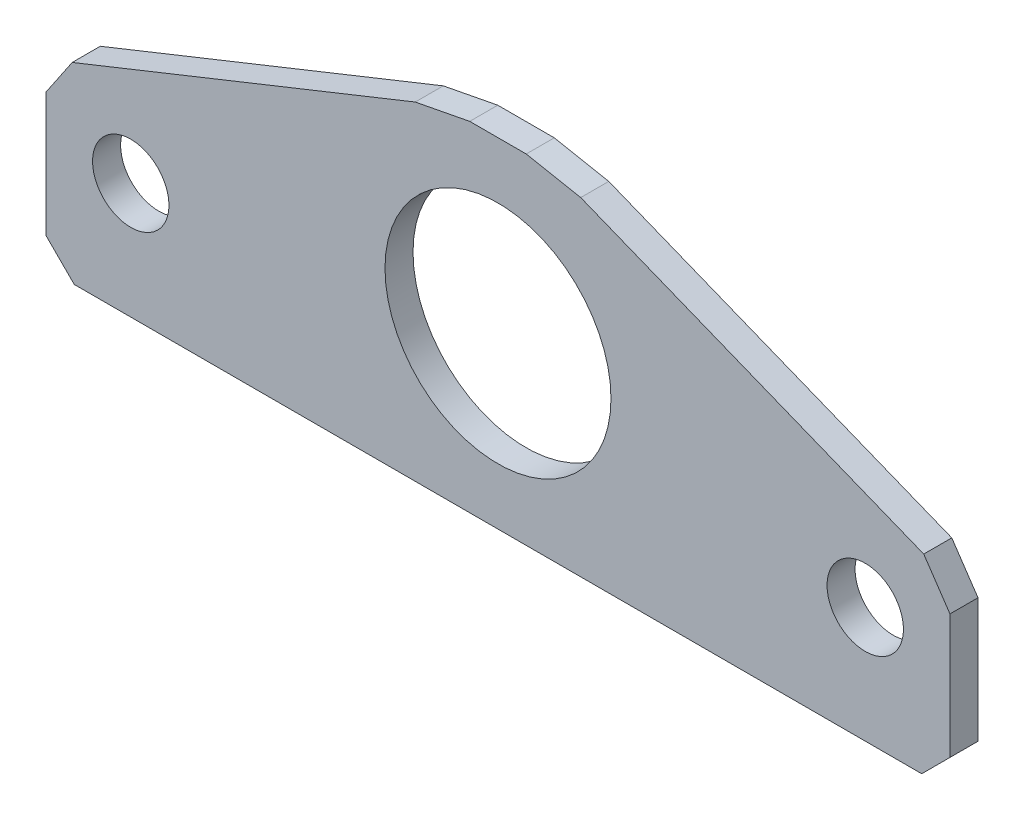
ISO-10303-21;
HEADER;
FILE_DESCRIPTION(('STEP AP214'),'2;1');
FILE_NAME('part.step','',(''),(''),'','','');
FILE_SCHEMA(('AUTOMOTIVE_DESIGN { 1 0 10303 214 1 1 1 1 }'));
ENDSEC;
DATA;
#1=APPLICATION_CONTEXT('core data for automotive mechanical design processes');
#2=APPLICATION_PROTOCOL_DEFINITION('international standard','automotive_design',2000,#1);
#3=PRODUCT_CONTEXT('',#1,'mechanical');
#4=PRODUCT('Part','Part','',(#3));
#5=PRODUCT_RELATED_PRODUCT_CATEGORY('part','',(#4));
#6=PRODUCT_DEFINITION_FORMATION('','',#4);
#7=PRODUCT_DEFINITION_CONTEXT('part definition',#1,'design');
#8=PRODUCT_DEFINITION('design','',#6,#7);
#9=PRODUCT_DEFINITION_SHAPE('','',#8);
#10=(LENGTH_UNIT() NAMED_UNIT(*) SI_UNIT(.MILLI.,.METRE.));
#11=(NAMED_UNIT(*) PLANE_ANGLE_UNIT() SI_UNIT($,.RADIAN.));
#12=(NAMED_UNIT(*) SI_UNIT($,.STERADIAN.) SOLID_ANGLE_UNIT());
#13=UNCERTAINTY_MEASURE_WITH_UNIT(LENGTH_MEASURE(1.E-05),#10,'distance_accuracy_value','');
#14=(GEOMETRIC_REPRESENTATION_CONTEXT(3) GLOBAL_UNCERTAINTY_ASSIGNED_CONTEXT((#13)) GLOBAL_UNIT_ASSIGNED_CONTEXT((#10,
#11,#12)) REPRESENTATION_CONTEXT('',''));
#15=CARTESIAN_POINT('',(0.,0.,0.));
#16=DIRECTION('',(0.,0.,1.));
#17=DIRECTION('',(1.,0.,0.));
#18=AXIS2_PLACEMENT_3D('',#15,#16,#17);
#19=CARTESIAN_POINT('',(25.4,20.955,1.5748));
#20=DIRECTION('',(0.,0.,-1.));
#21=DIRECTION('',(-1.,0.,0.));
#22=AXIS2_PLACEMENT_3D('',#19,#20,#21);
#23=PLANE('',#22);
#24=CARTESIAN_POINT('',(0.,0.,1.5748));
#25=DIRECTION('',(0.,0.,-1.));
#26=DIRECTION('',(-1.,0.,0.));
#27=AXIS2_PLACEMENT_3D('',#24,#25,#26);
#28=CIRCLE('',#27,6.35);
#29=CARTESIAN_POINT('',(-6.35,0.,1.5748));
#30=VERTEX_POINT('',#29);
#31=EDGE_CURVE('E135',#30,#30,#28,.T.);
#32=ORIENTED_EDGE('',*,*,#31,.T.);
#33=EDGE_LOOP('',(#32));
#34=FACE_BOUND('',#33,.T.);
#35=CARTESIAN_POINT('',(20.6375,-3.01285021,1.5748));
#36=DIRECTION('',(0.,0.,-1.));
#37=DIRECTION('',(-1.,0.,0.));
#38=AXIS2_PLACEMENT_3D('',#35,#36,#37);
#39=CIRCLE('',#38,2.1463);
#40=CARTESIAN_POINT('',(18.4912,-3.01285021,1.5748));
#41=VERTEX_POINT('',#40);
#42=EDGE_CURVE('E138',#41,#41,#39,.T.);
#43=ORIENTED_EDGE('',*,*,#42,.T.);
#44=EDGE_LOOP('',(#43));
#45=FACE_BOUND('',#44,.T.);
#46=CARTESIAN_POINT('',(-20.6375,-3.01285021,1.5748));
#47=DIRECTION('',(0.,0.,-1.));
#48=DIRECTION('',(-1.,0.,0.));
#49=AXIS2_PLACEMENT_3D('',#46,#47,#48);
#50=CIRCLE('',#49,2.1463);
#51=CARTESIAN_POINT('',(-22.7838,-3.01285021,1.5748));
#52=VERTEX_POINT('',#51);
#53=EDGE_CURVE('E20',#52,#52,#50,.T.);
#54=ORIENTED_EDGE('',*,*,#53,.T.);
#55=EDGE_LOOP('',(#54));
#56=FACE_BOUND('',#55,.T.);
#57=DIRECTION('',(0.560628809305184,0.828067230469272,0.));
#58=VECTOR('',#57,1.);
#59=CARTESIAN_POINT('',(-25.4,-0.9525,1.5748));
#60=LINE('',#59,#58);
#61=CARTESIAN_POINT('',(-23.9260432538003,1.22458269817676,1.5748));
#62=VERTEX_POINT('',#61);
#63=CARTESIAN_POINT('',(-25.4000000003079,-0.952500000699517,1.5748));
#64=VERTEX_POINT('',#63);
#65=EDGE_CURVE('E118',#62,#64,#60,.F.);
#66=ORIENTED_EDGE('',*,*,#65,.T.);
#67=DIRECTION('',(0.,1.,0.));
#68=VECTOR('',#67,1.);
#69=CARTESIAN_POINT('',(-25.4,0.635,1.5748));
#70=LINE('',#69,#68);
#71=CARTESIAN_POINT('',(-25.4000000002538,-7.93749999997375,1.5748));
#72=VERTEX_POINT('',#71);
#73=EDGE_CURVE('E108',#64,#72,#70,.F.);
#74=ORIENTED_EDGE('',*,*,#73,.T.);
#75=DIRECTION('',(-0.707106781186548,0.707106781186548,0.));
#76=VECTOR('',#75,1.);
#77=CARTESIAN_POINT('',(-23.8125,-9.525,1.5748));
#78=LINE('',#77,#76);
#79=CARTESIAN_POINT('',(-23.8125000002938,-9.52500000011875,1.5748));
#80=VERTEX_POINT('',#79);
#81=EDGE_CURVE('E143',#72,#80,#78,.F.);
#82=ORIENTED_EDGE('',*,*,#81,.T.);
#83=DIRECTION('',(-1.,0.,0.));
#84=VECTOR('',#83,1.);
#85=CARTESIAN_POINT('',(-25.4,-9.525,1.5748));
#86=LINE('',#85,#84);
#87=CARTESIAN_POINT('',(23.8124999995875,-9.525000000325,1.5748));
#88=VERTEX_POINT('',#87);
#89=EDGE_CURVE('E153',#80,#88,#86,.F.);
#90=ORIENTED_EDGE('',*,*,#89,.T.);
#91=DIRECTION('',(-0.707106781186548,-0.707106781186548,0.));
#92=VECTOR('',#91,1.);
#93=CARTESIAN_POINT('',(25.4,-7.9375,1.5748));
#94=LINE('',#93,#92);
#95=CARTESIAN_POINT('',(25.3999999999913,-7.93750000006125,1.5748));
#96=VERTEX_POINT('',#95);
#97=EDGE_CURVE('E157',#88,#96,#94,.F.);
#98=ORIENTED_EDGE('',*,*,#97,.T.);
#99=DIRECTION('',(0.,-1.,0.));
#100=VECTOR('',#99,1.);
#101=CARTESIAN_POINT('',(25.4,0.635,1.5748));
#102=LINE('',#101,#100);
#103=CARTESIAN_POINT('',(25.4000000001485,-0.952500000570449,1.5748));
#104=VERTEX_POINT('',#103);
#105=EDGE_CURVE('E162',#96,#104,#102,.F.);
#106=ORIENTED_EDGE('',*,*,#105,.T.);
#107=DIRECTION('',(0.560628809305184,-0.828067230469272,0.));
#108=VECTOR('',#107,1.);
#109=CARTESIAN_POINT('',(23.9260432532,1.22458269871,1.5748));
#110=LINE('',#109,#108);
#111=CARTESIAN_POINT('',(23.92604325322,1.22458269848268,1.5748));
#112=VERTEX_POINT('',#111);
#113=EDGE_CURVE('E167',#104,#112,#110,.F.);
#114=ORIENTED_EDGE('',*,*,#113,.T.);
#115=DIRECTION('',(0.928476690885259,-0.371390676354104,0.));
#116=VECTOR('',#115,1.);
#117=CARTESIAN_POINT('',(25.4,0.635,1.5748));
#118=LINE('',#117,#116);
#119=CARTESIAN_POINT('',(4.64895674721411,8.93541730136471,1.5748));
#120=VERTEX_POINT('',#119);
#121=EDGE_CURVE('E172',#112,#120,#118,.F.);
#122=ORIENTED_EDGE('',*,*,#121,.T.);
#123=DIRECTION('',(0.981956386731398,-0.189107521155077,0.));
#124=VECTOR('',#123,1.);
#125=CARTESIAN_POINT('',(1.5875,9.525,1.5748));
#126=LINE('',#125,#124);
#127=CARTESIAN_POINT('',(1.58749999998609,9.52500000007768,1.5748));
#128=VERTEX_POINT('',#127);
#129=EDGE_CURVE('E177',#120,#128,#126,.F.);
#130=ORIENTED_EDGE('',*,*,#129,.T.);
#131=DIRECTION('',(1.,0.,0.));
#132=VECTOR('',#131,1.);
#133=CARTESIAN_POINT('',(-3.175,9.525,1.5748));
#134=LINE('',#133,#132);
#135=CARTESIAN_POINT('',(-1.58750000070895,9.52500000001193,1.5748));
#136=VERTEX_POINT('',#135);
#137=EDGE_CURVE('E182',#128,#136,#134,.F.);
#138=ORIENTED_EDGE('',*,*,#137,.T.);
#139=DIRECTION('',(0.981956386731398,0.189107521155077,0.));
#140=VECTOR('',#139,1.);
#141=CARTESIAN_POINT('',(-4.64895674678,8.93541730129,1.5748));
#142=LINE('',#141,#140);
#143=CARTESIAN_POINT('',(-4.64895674615259,8.93541730160078,1.5748));
#144=VERTEX_POINT('',#143);
#145=EDGE_CURVE('E187',#136,#144,#142,.F.);
#146=ORIENTED_EDGE('',*,*,#145,.T.);
#147=DIRECTION('',(0.928476690885259,0.371390676354104,0.));
#148=VECTOR('',#147,1.);
#149=CARTESIAN_POINT('',(-25.4,0.635,1.5748));
#150=LINE('',#149,#148);
#151=EDGE_CURVE('E103',#144,#62,#150,.F.);
#152=ORIENTED_EDGE('',*,*,#151,.T.);
#153=EDGE_LOOP('',(#66,#74,#82,#90,#98,#106,#114,#122,#130,#138,#146,#152));
#154=FACE_BOUND('',#153,.T.);
#155=ADVANCED_FACE('F17',(#34,#45,#56,#154),#23,.F.);
#156=CARTESIAN_POINT('',(-25.4,0.635,1.5748));
#157=DIRECTION('',(1.,0.,0.));
#158=DIRECTION('',(0.,0.,-1.));
#159=AXIS2_PLACEMENT_3D('',#156,#157,#158);
#160=PLANE('',#159);
#161=DIRECTION('',(0.,0.,1.));
#162=VECTOR('',#161,1.);
#163=CARTESIAN_POINT('',(-25.4000000005315,-0.95250000078507,1.5748));
#164=LINE('',#163,#162);
#165=CARTESIAN_POINT('',(-25.4000000003079,-0.952500000699517,0.));
#166=VERTEX_POINT('',#165);
#167=EDGE_CURVE('E111',#64,#166,#164,.F.);
#168=ORIENTED_EDGE('',*,*,#167,.T.);
#169=DIRECTION('',(0.,1.,0.));
#170=VECTOR('',#169,1.);
#171=CARTESIAN_POINT('',(-25.4000000007,20.955,0.));
#172=LINE('',#171,#170);
#173=CARTESIAN_POINT('',(-25.4000000002537,-7.93749999997375,0.));
#174=VERTEX_POINT('',#173);
#175=EDGE_CURVE('E137',#174,#166,#172,.T.);
#176=ORIENTED_EDGE('',*,*,#175,.F.);
#177=DIRECTION('',(0.,0.,1.));
#178=VECTOR('',#177,1.);
#179=CARTESIAN_POINT('',(-25.400000000315,-7.937499999685,1.5748));
#180=LINE('',#179,#178);
#181=EDGE_CURVE('E114',#174,#72,#180,.T.);
#182=ORIENTED_EDGE('',*,*,#181,.T.);
#183=ORIENTED_EDGE('',*,*,#73,.F.);
#184=EDGE_LOOP('',(#168,#176,#182,#183));
#185=FACE_BOUND('',#184,.T.);
#186=ADVANCED_FACE('F109',(#185),#160,.F.);
#187=CARTESIAN_POINT('',(-25.4,-0.9525,1.5748));
#188=DIRECTION('',(0.828067230469272,-0.560628809305184,0.));
#189=DIRECTION('',(0.560628809305184,0.828067230469272,0.));
#190=AXIS2_PLACEMENT_3D('',#187,#188,#189);
#191=PLANE('',#190);
#192=DIRECTION('',(0.,0.,1.));
#193=VECTOR('',#192,1.);
#194=CARTESIAN_POINT('',(-23.9260432539241,1.22458269843035,1.5748));
#195=LINE('',#194,#193);
#196=CARTESIAN_POINT('',(-23.9260432537695,1.22458269815593,0.));
#197=VERTEX_POINT('',#196);
#198=EDGE_CURVE('E191',#62,#197,#195,.F.);
#199=ORIENTED_EDGE('',*,*,#198,.T.);
#200=DIRECTION('',(0.560628809322466,0.828067230457572,0.));
#201=VECTOR('',#200,1.);
#202=CARTESIAN_POINT('',(-25.4000000007,-0.952500000671,0.));
#203=LINE('',#202,#201);
#204=EDGE_CURVE('E124',#166,#197,#203,.T.);
#205=ORIENTED_EDGE('',*,*,#204,.F.);
#206=ORIENTED_EDGE('',*,*,#167,.F.);
#207=ORIENTED_EDGE('',*,*,#65,.F.);
#208=EDGE_LOOP('',(#199,#205,#206,#207));
#209=FACE_BOUND('',#208,.T.);
#210=ADVANCED_FACE('F122',(#209),#191,.F.);
#211=CARTESIAN_POINT('',(-25.4,0.635,1.5748));
#212=DIRECTION('',(0.371390676354104,-0.928476690885259,0.));
#213=DIRECTION('',(0.928476690885259,0.371390676354104,0.));
#214=AXIS2_PLACEMENT_3D('',#211,#212,#213);
#215=PLANE('',#214);
#216=ORIENTED_EDGE('',*,*,#198,.F.);
#217=ORIENTED_EDGE('',*,*,#151,.F.);
#218=DIRECTION('',(0.,0.,1.));
#219=VECTOR('',#218,1.);
#220=CARTESIAN_POINT('',(-4.64895674614975,8.93541730141138,1.5748));
#221=LINE('',#220,#219);
#222=CARTESIAN_POINT('',(-4.64895674615264,8.93541730160077,0.));
#223=VERTEX_POINT('',#222);
#224=EDGE_CURVE('E189',#144,#223,#221,.F.);
#225=ORIENTED_EDGE('',*,*,#224,.T.);
#226=DIRECTION('',(0.928476690873036,0.371390676384663,0.));
#227=VECTOR('',#226,1.);
#228=CARTESIAN_POINT('',(-23.9260432538,1.22458269812,0.));
#229=LINE('',#228,#227);
#230=EDGE_CURVE('E195',#197,#223,#229,.T.);
#231=ORIENTED_EDGE('',*,*,#230,.F.);
#232=EDGE_LOOP('',(#216,#217,#225,#231));
#233=FACE_BOUND('',#232,.T.);
#234=ADVANCED_FACE('F196',(#233),#215,.F.);
#235=CARTESIAN_POINT('',(-4.64895674678,8.93541730129,1.5748));
#236=DIRECTION('',(0.189107521155077,-0.981956386731398,0.));
#237=DIRECTION('',(0.981956386731398,0.189107521155077,0.));
#238=AXIS2_PLACEMENT_3D('',#235,#236,#237);
#239=PLANE('',#238);
#240=DIRECTION('',(0.,0.,-1.));
#241=VECTOR('',#240,1.);
#242=CARTESIAN_POINT('',(-1.58750000075,9.525,1.5748));
#243=LINE('',#242,#241);
#244=CARTESIAN_POINT('',(-1.58750000070895,9.52500000001193,0.));
#245=VERTEX_POINT('',#244);
#246=EDGE_CURVE('E185',#136,#245,#243,.T.);
#247=ORIENTED_EDGE('',*,*,#246,.T.);
#248=DIRECTION('',(0.981956386734021,0.189107521141454,0.));
#249=VECTOR('',#248,1.);
#250=CARTESIAN_POINT('',(-4.64895674624,8.93541730188,0.));
#251=LINE('',#250,#249);
#252=EDGE_CURVE('E201',#223,#245,#251,.T.);
#253=ORIENTED_EDGE('',*,*,#252,.F.);
#254=ORIENTED_EDGE('',*,*,#224,.F.);
#255=ORIENTED_EDGE('',*,*,#145,.F.);
#256=EDGE_LOOP('',(#247,#253,#254,#255));
#257=FACE_BOUND('',#256,.T.);
#258=ADVANCED_FACE('F351',(#257),#239,.F.);
#259=CARTESIAN_POINT('',(-3.175,9.525,1.5748));
#260=DIRECTION('',(0.,-1.,0.));
#261=DIRECTION('',(0.,0.,-1.));
#262=AXIS2_PLACEMENT_3D('',#259,#260,#261);
#263=PLANE('',#262);
#264=DIRECTION('',(0.,0.,1.));
#265=VECTOR('',#264,1.);
#266=CARTESIAN_POINT('',(1.58749999994429,9.52500000001073,1.5748));
#267=LINE('',#266,#265);
#268=CARTESIAN_POINT('',(1.58749999998609,9.52500000007768,0.));
#269=VERTEX_POINT('',#268);
#270=EDGE_CURVE('E180',#128,#269,#267,.F.);
#271=ORIENTED_EDGE('',*,*,#270,.T.);
#272=DIRECTION('',(-1.,0.,0.));
#273=VECTOR('',#272,1.);
#274=CARTESIAN_POINT('',(25.4,9.5250000003,0.));
#275=LINE('',#274,#273);
#276=EDGE_CURVE('E208',#245,#269,#275,.F.);
#277=ORIENTED_EDGE('',*,*,#276,.F.);
#278=ORIENTED_EDGE('',*,*,#246,.F.);
#279=ORIENTED_EDGE('',*,*,#137,.F.);
#280=EDGE_LOOP('',(#271,#277,#278,#279));
#281=FACE_BOUND('',#280,.T.);
#282=ADVANCED_FACE('F342',(#281),#263,.F.);
#283=CARTESIAN_POINT('',(1.5875,9.525,1.5748));
#284=DIRECTION('',(-0.189107521155077,-0.981956386731398,0.));
#285=DIRECTION('',(0.981956386731398,-0.189107521155077,0.));
#286=AXIS2_PLACEMENT_3D('',#283,#284,#285);
#287=PLANE('',#286);
#288=DIRECTION('',(0.,0.,1.));
#289=VECTOR('',#288,1.);
#290=CARTESIAN_POINT('',(4.64895674706724,8.93541730117311,1.5748));
#291=LINE('',#290,#289);
#292=CARTESIAN_POINT('',(4.64895674721411,8.93541730136471,0.));
#293=VERTEX_POINT('',#292);
#294=EDGE_CURVE('E175',#120,#293,#291,.F.);
#295=ORIENTED_EDGE('',*,*,#294,.T.);
#296=DIRECTION('',(0.981956386755356,-0.18910752103067,0.));
#297=VECTOR('',#296,1.);
#298=CARTESIAN_POINT('',(1.5875,9.5250000003,0.));
#299=LINE('',#298,#297);
#300=EDGE_CURVE('E211',#269,#293,#299,.T.);
#301=ORIENTED_EDGE('',*,*,#300,.F.);
#302=ORIENTED_EDGE('',*,*,#270,.F.);
#303=ORIENTED_EDGE('',*,*,#129,.F.);
#304=EDGE_LOOP('',(#295,#301,#302,#303));
#305=FACE_BOUND('',#304,.T.);
#306=ADVANCED_FACE('F333',(#305),#287,.F.);
#307=CARTESIAN_POINT('',(25.4,0.635,1.5748));
#308=DIRECTION('',(-0.371390676354104,-0.928476690885259,0.));
#309=DIRECTION('',(0.928476690885259,-0.371390676354104,0.));
#310=AXIS2_PLACEMENT_3D('',#307,#308,#309);
#311=PLANE('',#310);
#312=DIRECTION('',(0.,0.,1.));
#313=VECTOR('',#312,1.);
#314=CARTESIAN_POINT('',(23.926043253411,1.22458269839829,1.5748));
#315=LINE('',#314,#313);
#316=CARTESIAN_POINT('',(23.92604325322,1.22458269848268,0.));
#317=VERTEX_POINT('',#316);
#318=EDGE_CURVE('E170',#112,#317,#315,.F.);
#319=ORIENTED_EDGE('',*,*,#318,.T.);
#320=DIRECTION('',(0.928476690860347,-0.371390676416386,0.));
#321=VECTOR('',#320,1.);
#322=CARTESIAN_POINT('',(4.64895674735,8.93541730188,0.));
#323=LINE('',#322,#321);
#324=EDGE_CURVE('E214',#293,#317,#323,.T.);
#325=ORIENTED_EDGE('',*,*,#324,.F.);
#326=ORIENTED_EDGE('',*,*,#294,.F.);
#327=ORIENTED_EDGE('',*,*,#121,.F.);
#328=EDGE_LOOP('',(#319,#325,#326,#327));
#329=FACE_BOUND('',#328,.T.);
#330=ADVANCED_FACE('F324',(#329),#311,.F.);
#331=CARTESIAN_POINT('',(23.9260432532,1.22458269871,1.5748));
#332=DIRECTION('',(-0.828067230469272,-0.560628809305184,0.));
#333=DIRECTION('',(0.560628809305184,-0.828067230469272,0.));
#334=AXIS2_PLACEMENT_3D('',#331,#332,#333);
#335=PLANE('',#334);
#336=DIRECTION('',(0.,0.,1.));
#337=VECTOR('',#336,1.);
#338=CARTESIAN_POINT('',(25.4,-0.952500000671,1.5748));
#339=LINE('',#338,#337);
#340=CARTESIAN_POINT('',(25.4000000001485,-0.952500000570449,0.));
#341=VERTEX_POINT('',#340);
#342=EDGE_CURVE('E165',#104,#341,#339,.F.);
#343=ORIENTED_EDGE('',*,*,#342,.T.);
#344=DIRECTION('',(0.560628809348545,-0.828067230439916,0.));
#345=VECTOR('',#344,1.);
#346=CARTESIAN_POINT('',(23.926043253,1.22458269812,0.));
#347=LINE('',#346,#345);
#348=EDGE_CURVE('E217',#317,#341,#347,.T.);
#349=ORIENTED_EDGE('',*,*,#348,.F.);
#350=ORIENTED_EDGE('',*,*,#318,.F.);
#351=ORIENTED_EDGE('',*,*,#113,.F.);
#352=EDGE_LOOP('',(#343,#349,#350,#351));
#353=FACE_BOUND('',#352,.T.);
#354=ADVANCED_FACE('F315',(#353),#335,.F.);
#355=CARTESIAN_POINT('',(25.4,0.635,1.5748));
#356=DIRECTION('',(-1.,0.,0.));
#357=DIRECTION('',(0.,-1.,0.));
#358=AXIS2_PLACEMENT_3D('',#355,#356,#357);
#359=PLANE('',#358);
#360=DIRECTION('',(0.,0.,1.));
#361=VECTOR('',#360,1.);
#362=CARTESIAN_POINT('',(25.399999999965,-7.937500000035,1.5748));
#363=LINE('',#362,#361);
#364=CARTESIAN_POINT('',(25.3999999999913,-7.93750000006125,0.));
#365=VERTEX_POINT('',#364);
#366=EDGE_CURVE('E160',#96,#365,#363,.F.);
#367=ORIENTED_EDGE('',*,*,#366,.T.);
#368=DIRECTION('',(0.,1.,0.));
#369=VECTOR('',#368,1.);
#370=CARTESIAN_POINT('',(25.4,20.955,0.));
#371=LINE('',#370,#369);
#372=EDGE_CURVE('E220',#341,#365,#371,.F.);
#373=ORIENTED_EDGE('',*,*,#372,.F.);
#374=ORIENTED_EDGE('',*,*,#342,.F.);
#375=ORIENTED_EDGE('',*,*,#105,.F.);
#376=EDGE_LOOP('',(#367,#373,#374,#375));
#377=FACE_BOUND('',#376,.T.);
#378=ADVANCED_FACE('F306',(#377),#359,.F.);
#379=CARTESIAN_POINT('',(25.4,-7.9375,1.5748));
#380=DIRECTION('',(-0.707106781186548,0.707106781186548,0.));
#381=DIRECTION('',(-0.707106781186548,-0.707106781186548,0.));
#382=AXIS2_PLACEMENT_3D('',#379,#380,#381);
#383=PLANE('',#382);
#384=DIRECTION('',(0.,0.,1.));
#385=VECTOR('',#384,1.);
#386=CARTESIAN_POINT('',(23.8124999996,-9.52499999999999,1.5748));
#387=LINE('',#386,#385);
#388=CARTESIAN_POINT('',(23.8124999995875,-9.525000000325,0.));
#389=VERTEX_POINT('',#388);
#390=EDGE_CURVE('E155',#88,#389,#387,.F.);
#391=ORIENTED_EDGE('',*,*,#390,.T.);
#392=DIRECTION('',(-0.707106781191001,-0.707106781182094,0.));
#393=VECTOR('',#392,1.);
#394=CARTESIAN_POINT('',(25.4,-7.93750000007,0.));
#395=LINE('',#394,#393);
#396=EDGE_CURVE('E223',#365,#389,#395,.T.);
#397=ORIENTED_EDGE('',*,*,#396,.F.);
#398=ORIENTED_EDGE('',*,*,#366,.F.);
#399=ORIENTED_EDGE('',*,*,#97,.F.);
#400=EDGE_LOOP('',(#391,#397,#398,#399));
#401=FACE_BOUND('',#400,.T.);
#402=ADVANCED_FACE('F242',(#401),#383,.F.);
#403=CARTESIAN_POINT('',(-25.4,-9.525,1.5748));
#404=DIRECTION('',(0.,1.,0.));
#405=DIRECTION('',(-1.,0.,0.));
#406=AXIS2_PLACEMENT_3D('',#403,#404,#405);
#407=PLANE('',#406);
#408=DIRECTION('',(0.,0.,1.));
#409=VECTOR('',#408,1.);
#410=CARTESIAN_POINT('',(-23.812499999975,-9.525000000025,1.5748));
#411=LINE('',#410,#409);
#412=CARTESIAN_POINT('',(-23.8125000002938,-9.52500000011875,0.));
#413=VERTEX_POINT('',#412);
#414=EDGE_CURVE('E35',#80,#413,#411,.F.);
#415=ORIENTED_EDGE('',*,*,#414,.T.);
#416=DIRECTION('',(-1.,0.,0.));
#417=VECTOR('',#416,1.);
#418=CARTESIAN_POINT('',(25.4,-9.52500000045,0.));
#419=LINE('',#418,#417);
#420=EDGE_CURVE('E226',#389,#413,#419,.T.);
#421=ORIENTED_EDGE('',*,*,#420,.F.);
#422=ORIENTED_EDGE('',*,*,#390,.F.);
#423=ORIENTED_EDGE('',*,*,#89,.F.);
#424=EDGE_LOOP('',(#415,#421,#422,#423));
#425=FACE_BOUND('',#424,.T.);
#426=ADVANCED_FACE('F232',(#425),#407,.F.);
#427=CARTESIAN_POINT('',(-23.8125,-9.525,1.5748));
#428=DIRECTION('',(0.707106781186548,0.707106781186548,0.));
#429=DIRECTION('',(-0.707106781186548,0.707106781186548,0.));
#430=AXIS2_PLACEMENT_3D('',#427,#428,#429);
#431=PLANE('',#430);
#432=ORIENTED_EDGE('',*,*,#181,.F.);
#433=DIRECTION('',(-0.707106781168731,0.707106781204364,0.));
#434=VECTOR('',#433,1.);
#435=CARTESIAN_POINT('',(-23.8125000004,-9.52500000045,0.));
#436=LINE('',#435,#434);
#437=EDGE_CURVE('E134',#413,#174,#436,.T.);
#438=ORIENTED_EDGE('',*,*,#437,.F.);
#439=ORIENTED_EDGE('',*,*,#414,.F.);
#440=ORIENTED_EDGE('',*,*,#81,.F.);
#441=EDGE_LOOP('',(#432,#438,#439,#440));
#442=FACE_BOUND('',#441,.T.);
#443=ADVANCED_FACE('F229',(#442),#431,.F.);
#444=CARTESIAN_POINT('',(-20.6375,-3.01285021,1.5748));
#445=DIRECTION('',(0.,0.,-1.));
#446=DIRECTION('',(-1.,0.,0.));
#447=AXIS2_PLACEMENT_3D('',#444,#445,#446);
#448=CYLINDRICAL_SURFACE('',#447,2.1463);
#449=ORIENTED_EDGE('',*,*,#53,.F.);
#450=EDGE_LOOP('',(#449));
#451=FACE_BOUND('',#450,.T.);
#452=CARTESIAN_POINT('',(-20.6375,-3.01285021,4.05311634948946E-10));
#453=DIRECTION('',(0.,0.,-1.));
#454=DIRECTION('',(-1.,0.,0.));
#455=AXIS2_PLACEMENT_3D('',#452,#453,#454);
#456=CIRCLE('',#455,2.1463);
#457=CARTESIAN_POINT('',(-22.7838,-3.01285021,4.05311634948946E-10));
#458=VERTEX_POINT('',#457);
#459=EDGE_CURVE('E131',#458,#458,#456,.F.);
#460=ORIENTED_EDGE('',*,*,#459,.F.);
#461=EDGE_LOOP('',(#460));
#462=FACE_BOUND('',#461,.T.);
#463=ADVANCED_FACE('F231',(#451,#462),#448,.F.);
#464=CARTESIAN_POINT('',(20.6375,-3.01285021,1.5748));
#465=DIRECTION('',(0.,0.,-1.));
#466=DIRECTION('',(-1.,0.,0.));
#467=AXIS2_PLACEMENT_3D('',#464,#465,#466);
#468=CYLINDRICAL_SURFACE('',#467,2.1463);
#469=ORIENTED_EDGE('',*,*,#42,.F.);
#470=EDGE_LOOP('',(#469));
#471=FACE_BOUND('',#470,.T.);
#472=CARTESIAN_POINT('',(20.6375,-3.01285021,4.05311634948946E-10));
#473=DIRECTION('',(0.,0.,-1.));
#474=DIRECTION('',(-1.,0.,0.));
#475=AXIS2_PLACEMENT_3D('',#472,#473,#474);
#476=CIRCLE('',#475,2.1463);
#477=CARTESIAN_POINT('',(18.4912,-3.01285021,4.05311634948946E-10));
#478=VERTEX_POINT('',#477);
#479=EDGE_CURVE('E26',#478,#478,#476,.F.);
#480=ORIENTED_EDGE('',*,*,#479,.F.);
#481=EDGE_LOOP('',(#480));
#482=FACE_BOUND('',#481,.T.);
#483=ADVANCED_FACE('F239',(#471,#482),#468,.F.);
#484=CARTESIAN_POINT('',(0.,0.,1.5748));
#485=DIRECTION('',(0.,0.,-1.));
#486=DIRECTION('',(-1.,0.,0.));
#487=AXIS2_PLACEMENT_3D('',#484,#485,#486);
#488=CYLINDRICAL_SURFACE('',#487,6.35);
#489=ORIENTED_EDGE('',*,*,#31,.F.);
#490=EDGE_LOOP('',(#489));
#491=FACE_BOUND('',#490,.T.);
#492=CARTESIAN_POINT('',(0.,0.,4.05311634948946E-10));
#493=DIRECTION('',(0.,0.,-1.));
#494=DIRECTION('',(-1.,0.,0.));
#495=AXIS2_PLACEMENT_3D('',#492,#493,#494);
#496=CIRCLE('',#495,6.35);
#497=CARTESIAN_POINT('',(-6.35,0.,4.05311634948946E-10));
#498=VERTEX_POINT('',#497);
#499=EDGE_CURVE('E11',#498,#498,#496,.F.);
#500=ORIENTED_EDGE('',*,*,#499,.F.);
#501=EDGE_LOOP('',(#500));
#502=FACE_BOUND('',#501,.T.);
#503=ADVANCED_FACE('F245',(#491,#502),#488,.F.);
#504=CARTESIAN_POINT('',(25.4,20.955,0.));
#505=DIRECTION('',(0.,0.,-1.));
#506=DIRECTION('',(-1.,0.,0.));
#507=AXIS2_PLACEMENT_3D('',#504,#505,#506);
#508=PLANE('',#507);
#509=ORIENTED_EDGE('',*,*,#499,.T.);
#510=EDGE_LOOP('',(#509));
#511=FACE_BOUND('',#510,.T.);
#512=ORIENTED_EDGE('',*,*,#479,.T.);
#513=EDGE_LOOP('',(#512));
#514=FACE_BOUND('',#513,.T.);
#515=ORIENTED_EDGE('',*,*,#459,.T.);
#516=EDGE_LOOP('',(#515));
#517=FACE_BOUND('',#516,.T.);
#518=ORIENTED_EDGE('',*,*,#420,.T.);
#519=ORIENTED_EDGE('',*,*,#437,.T.);
#520=ORIENTED_EDGE('',*,*,#175,.T.);
#521=ORIENTED_EDGE('',*,*,#204,.T.);
#522=ORIENTED_EDGE('',*,*,#230,.T.);
#523=ORIENTED_EDGE('',*,*,#252,.T.);
#524=ORIENTED_EDGE('',*,*,#276,.T.);
#525=ORIENTED_EDGE('',*,*,#300,.T.);
#526=ORIENTED_EDGE('',*,*,#324,.T.);
#527=ORIENTED_EDGE('',*,*,#348,.T.);
#528=ORIENTED_EDGE('',*,*,#372,.T.);
#529=ORIENTED_EDGE('',*,*,#396,.T.);
#530=EDGE_LOOP('',(#518,#519,#520,#521,#522,#523,#524,#525,#526,#527,#528,#529));
#531=FACE_BOUND('',#530,.T.);
#532=ADVANCED_FACE('F204',(#511,#514,#517,#531),#508,.T.);
#533=CLOSED_SHELL('',(#155,#186,#210,#234,#258,#282,#306,#330,#354,#378,#402,#426,#443,#463,
#483,#503,#532));
#534=MANIFOLD_SOLID_BREP('B1',#533);
#535=ADVANCED_BREP_SHAPE_REPRESENTATION('',(#18,#534),#14);
#536=SHAPE_DEFINITION_REPRESENTATION(#9,#535);
ENDSEC;
END-ISO-10303-21;
